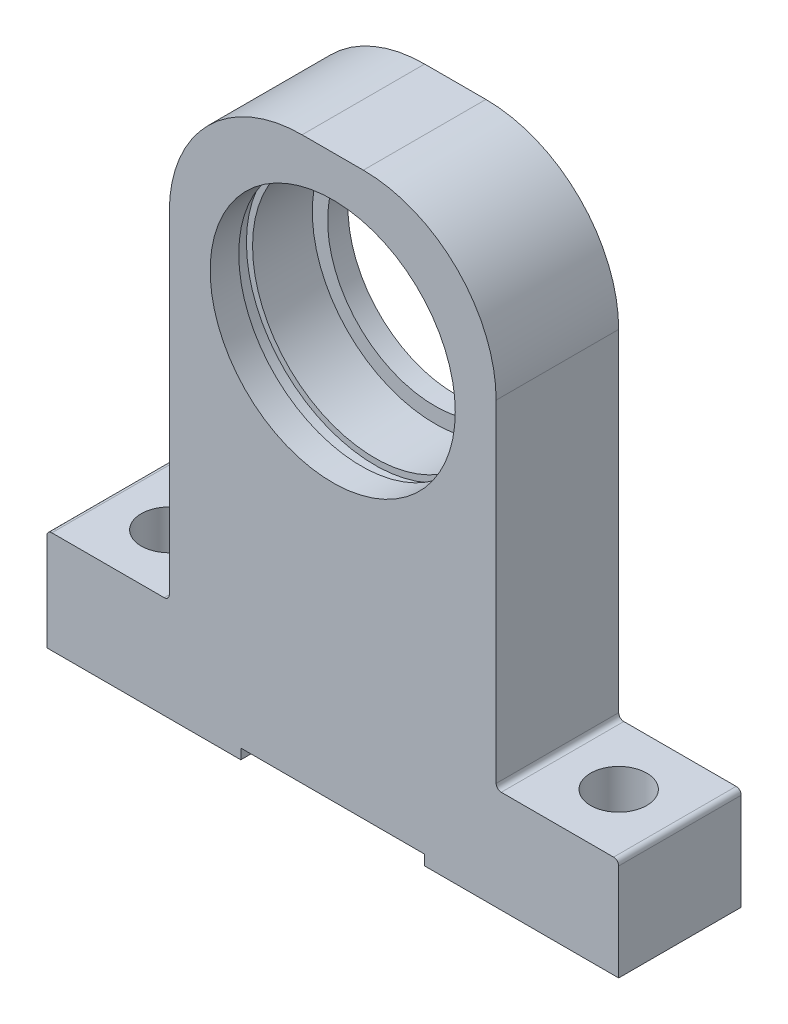
ISO-10303-21;
HEADER;
FILE_DESCRIPTION(('STEP AP214'),'2;1');
FILE_NAME('part.step','',(''),(''),'','','');
FILE_SCHEMA(('AUTOMOTIVE_DESIGN { 1 0 10303 214 1 1 1 1 }'));
ENDSEC;
DATA;
#1=APPLICATION_CONTEXT('core data for automotive mechanical design processes');
#2=APPLICATION_PROTOCOL_DEFINITION('international standard','automotive_design',2000,#1);
#3=PRODUCT_CONTEXT('',#1,'mechanical');
#4=PRODUCT('Part','Part','',(#3));
#5=PRODUCT_RELATED_PRODUCT_CATEGORY('part','',(#4));
#6=PRODUCT_DEFINITION_FORMATION('','',#4);
#7=PRODUCT_DEFINITION_CONTEXT('part definition',#1,'design');
#8=PRODUCT_DEFINITION('design','',#6,#7);
#9=PRODUCT_DEFINITION_SHAPE('','',#8);
#10=(LENGTH_UNIT() NAMED_UNIT(*) SI_UNIT(.MILLI.,.METRE.));
#11=(NAMED_UNIT(*) PLANE_ANGLE_UNIT() SI_UNIT($,.RADIAN.));
#12=(NAMED_UNIT(*) SI_UNIT($,.STERADIAN.) SOLID_ANGLE_UNIT());
#13=UNCERTAINTY_MEASURE_WITH_UNIT(LENGTH_MEASURE(1.E-05),#10,'distance_accuracy_value','');
#14=(GEOMETRIC_REPRESENTATION_CONTEXT(3) GLOBAL_UNCERTAINTY_ASSIGNED_CONTEXT((#13)) GLOBAL_UNIT_ASSIGNED_CONTEXT((#10,
#11,#12)) REPRESENTATION_CONTEXT('',''));
#15=CARTESIAN_POINT('',(0.,0.,0.));
#16=DIRECTION('',(0.,0.,1.));
#17=DIRECTION('',(1.,0.,0.));
#18=AXIS2_PLACEMENT_3D('',#15,#16,#17);
#19=CARTESIAN_POINT('',(0.,0.,2.));
#20=DIRECTION('',(0.,0.,1.));
#21=DIRECTION('',(1.,0.,0.));
#22=AXIS2_PLACEMENT_3D('',#19,#20,#21);
#23=CYLINDRICAL_SURFACE('',#22,12.);
#24=CARTESIAN_POINT('',(0.,0.,9.2));
#25=DIRECTION('',(0.,0.,-1.));
#26=DIRECTION('',(-1.,0.,0.));
#27=AXIS2_PLACEMENT_3D('',#24,#25,#26);
#28=CIRCLE('',#27,12.);
#29=CARTESIAN_POINT('',(-12.,0.,9.2));
#30=VERTEX_POINT('',#29);
#31=EDGE_CURVE('E329',#30,#30,#28,.T.);
#32=ORIENTED_EDGE('',*,*,#31,.T.);
#33=EDGE_LOOP('',(#32));
#34=FACE_BOUND('',#33,.T.);
#35=CARTESIAN_POINT('',(0.,0.,12.));
#36=DIRECTION('',(0.,0.,1.));
#37=DIRECTION('',(1.,0.,0.));
#38=AXIS2_PLACEMENT_3D('',#35,#36,#37);
#39=CIRCLE('',#38,12.);
#40=CARTESIAN_POINT('',(12.,0.,12.));
#41=VERTEX_POINT('',#40);
#42=EDGE_CURVE('E312',#41,#41,#39,.T.);
#43=ORIENTED_EDGE('',*,*,#42,.T.);
#44=EDGE_LOOP('',(#43));
#45=FACE_BOUND('',#44,.T.);
#46=ADVANCED_FACE('F34',(#34,#45),#23,.F.);
#47=CARTESIAN_POINT('',(-28.,-40.,12.));
#48=DIRECTION('',(0.,1.,0.));
#49=DIRECTION('',(-1.,0.,0.));
#50=AXIS2_PLACEMENT_3D('',#47,#48,#49);
#51=PLANE('',#50);
#52=CARTESIAN_POINT('',(-22.,-40.,6.));
#53=DIRECTION('',(0.,1.,0.));
#54=DIRECTION('',(0.,0.,1.));
#55=AXIS2_PLACEMENT_3D('',#52,#53,#54);
#56=CIRCLE('',#55,2.75);
#57=CARTESIAN_POINT('',(-22.,-40.,8.75));
#58=VERTEX_POINT('',#57);
#59=EDGE_CURVE('E299',#58,#58,#56,.T.);
#60=ORIENTED_EDGE('',*,*,#59,.T.);
#61=EDGE_LOOP('',(#60));
#62=FACE_BOUND('',#61,.T.);
#63=DIRECTION('',(1.,0.,0.));
#64=VECTOR('',#63,1.);
#65=CARTESIAN_POINT('',(-28.,-40.,0.));
#66=LINE('',#65,#64);
#67=CARTESIAN_POINT('',(-28.,-40.,0.));
#68=VERTEX_POINT('',#67);
#69=CARTESIAN_POINT('',(-9.,-40.,0.));
#70=VERTEX_POINT('',#69);
#71=EDGE_CURVE('E178',#68,#70,#66,.T.);
#72=ORIENTED_EDGE('',*,*,#71,.T.);
#73=DIRECTION('',(0.,0.,1.));
#74=VECTOR('',#73,1.);
#75=CARTESIAN_POINT('',(-9.,-40.,0.));
#76=LINE('',#75,#74);
#77=CARTESIAN_POINT('',(-9.,-40.,12.));
#78=VERTEX_POINT('',#77);
#79=EDGE_CURVE('E160',#70,#78,#76,.T.);
#80=ORIENTED_EDGE('',*,*,#79,.T.);
#81=DIRECTION('',(1.,0.,0.));
#82=VECTOR('',#81,1.);
#83=CARTESIAN_POINT('',(-28.,-40.,12.));
#84=LINE('',#83,#82);
#85=CARTESIAN_POINT('',(-28.,-40.,12.));
#86=VERTEX_POINT('',#85);
#87=EDGE_CURVE('E230',#86,#78,#84,.T.);
#88=ORIENTED_EDGE('',*,*,#87,.F.);
#89=DIRECTION('',(0.,0.,-1.));
#90=VECTOR('',#89,1.);
#91=CARTESIAN_POINT('',(-28.,-40.,12.));
#92=LINE('',#91,#90);
#93=EDGE_CURVE('E11',#86,#68,#92,.T.);
#94=ORIENTED_EDGE('',*,*,#93,.T.);
#95=EDGE_LOOP('',(#72,#80,#88,#94));
#96=FACE_BOUND('',#95,.T.);
#97=ADVANCED_FACE('F182',(#62,#96),#51,.F.);
#98=CARTESIAN_POINT('',(0.,0.,12.));
#99=DIRECTION('',(0.,0.,-1.));
#100=DIRECTION('',(-1.,0.,0.));
#101=AXIS2_PLACEMENT_3D('',#98,#99,#100);
#102=CYLINDRICAL_SURFACE('',#101,10.5);
#103=CARTESIAN_POINT('',(0.,0.,0.));
#104=DIRECTION('',(0.,0.,1.));
#105=DIRECTION('',(1.,0.,0.));
#106=AXIS2_PLACEMENT_3D('',#103,#104,#105);
#107=CIRCLE('',#106,10.5);
#108=CARTESIAN_POINT('',(10.5,0.,0.));
#109=VERTEX_POINT('',#108);
#110=EDGE_CURVE('E234',#109,#109,#107,.T.);
#111=ORIENTED_EDGE('',*,*,#110,.F.);
#112=EDGE_LOOP('',(#111));
#113=FACE_BOUND('',#112,.T.);
#114=CARTESIAN_POINT('',(0.,0.,2.));
#115=DIRECTION('',(0.,0.,1.));
#116=DIRECTION('',(1.,0.,0.));
#117=AXIS2_PLACEMENT_3D('',#114,#115,#116);
#118=CIRCLE('',#117,10.5);
#119=CARTESIAN_POINT('',(10.5,0.,2.));
#120=VERTEX_POINT('',#119);
#121=EDGE_CURVE('E38',#120,#120,#118,.T.);
#122=ORIENTED_EDGE('',*,*,#121,.T.);
#123=EDGE_LOOP('',(#122));
#124=FACE_BOUND('',#123,.T.);
#125=ADVANCED_FACE('F380',(#113,#124),#102,.F.);
#126=CARTESIAN_POINT('',(0.,0.,12.));
#127=DIRECTION('',(0.,0.,1.));
#128=DIRECTION('',(1.,0.,0.));
#129=AXIS2_PLACEMENT_3D('',#126,#127,#128);
#130=PLANE('',#129);
#131=DIRECTION('',(0.,-1.,0.));
#132=VECTOR('',#131,1.);
#133=CARTESIAN_POINT('',(-9.,-40.,12.));
#134=LINE('',#133,#132);
#135=CARTESIAN_POINT('',(-9.,-39.,12.));
#136=VERTEX_POINT('',#135);
#137=EDGE_CURVE('E166',#136,#78,#134,.T.);
#138=ORIENTED_EDGE('',*,*,#137,.F.);
#139=DIRECTION('',(-1.,0.,0.));
#140=VECTOR('',#139,1.);
#141=CARTESIAN_POINT('',(-9.,-39.,12.));
#142=LINE('',#141,#140);
#143=CARTESIAN_POINT('',(9.,-39.,12.));
#144=VERTEX_POINT('',#143);
#145=EDGE_CURVE('E180',#144,#136,#142,.T.);
#146=ORIENTED_EDGE('',*,*,#145,.F.);
#147=DIRECTION('',(0.,1.,0.));
#148=VECTOR('',#147,1.);
#149=CARTESIAN_POINT('',(9.,-40.,12.));
#150=LINE('',#149,#148);
#151=CARTESIAN_POINT('',(9.,-40.,12.));
#152=VERTEX_POINT('',#151);
#153=EDGE_CURVE('E325',#152,#144,#150,.T.);
#154=ORIENTED_EDGE('',*,*,#153,.F.);
#155=CARTESIAN_POINT('',(28.,-40.,12.));
#156=VERTEX_POINT('',#155);
#157=EDGE_CURVE('E232',#152,#156,#84,.T.);
#158=ORIENTED_EDGE('',*,*,#157,.T.);
#159=DIRECTION('',(0.,1.,0.));
#160=VECTOR('',#159,1.);
#161=CARTESIAN_POINT('',(28.,-40.,12.));
#162=LINE('',#161,#160);
#163=CARTESIAN_POINT('',(28.,-30.5,12.));
#164=VERTEX_POINT('',#163);
#165=EDGE_CURVE('E227',#156,#164,#162,.T.);
#166=ORIENTED_EDGE('',*,*,#165,.T.);
#167=CARTESIAN_POINT('',(27.5,-30.5,12.));
#168=DIRECTION('',(0.,0.,-1.));
#169=DIRECTION('',(-1.,0.,0.));
#170=AXIS2_PLACEMENT_3D('',#167,#168,#169);
#171=CIRCLE('',#170,0.500000000000007);
#172=CARTESIAN_POINT('',(27.5,-30.,12.));
#173=VERTEX_POINT('',#172);
#174=EDGE_CURVE('E58',#173,#164,#171,.T.);
#175=ORIENTED_EDGE('',*,*,#174,.F.);
#176=DIRECTION('',(-1.,0.,0.));
#177=VECTOR('',#176,1.);
#178=CARTESIAN_POINT('',(28.,-30.,12.));
#179=LINE('',#178,#177);
#180=CARTESIAN_POINT('',(16.5,-30.,12.));
#181=VERTEX_POINT('',#180);
#182=EDGE_CURVE('E225',#173,#181,#179,.T.);
#183=ORIENTED_EDGE('',*,*,#182,.T.);
#184=CARTESIAN_POINT('',(16.5,-29.5,12.));
#185=DIRECTION('',(0.,0.,-1.));
#186=DIRECTION('',(1.,0.,0.));
#187=AXIS2_PLACEMENT_3D('',#184,#185,#186);
#188=CIRCLE('',#187,0.500000000000007);
#189=CARTESIAN_POINT('',(16.,-29.5,12.));
#190=VERTEX_POINT('',#189);
#191=EDGE_CURVE('E264',#181,#190,#188,.T.);
#192=ORIENTED_EDGE('',*,*,#191,.T.);
#193=DIRECTION('',(0.,1.,0.));
#194=VECTOR('',#193,1.);
#195=CARTESIAN_POINT('',(16.,-30.,12.));
#196=LINE('',#195,#194);
#197=CARTESIAN_POINT('',(16.,3.,12.));
#198=VERTEX_POINT('',#197);
#199=EDGE_CURVE('E223',#190,#198,#196,.T.);
#200=ORIENTED_EDGE('',*,*,#199,.T.);
#201=CARTESIAN_POINT('',(3.00000000000001,3.,12.));
#202=DIRECTION('',(0.,0.,-1.));
#203=DIRECTION('',(-1.,0.,0.));
#204=AXIS2_PLACEMENT_3D('',#201,#202,#203);
#205=CIRCLE('',#204,13.);
#206=CARTESIAN_POINT('',(3.,16.,12.));
#207=VERTEX_POINT('',#206);
#208=EDGE_CURVE('E243',#207,#198,#205,.T.);
#209=ORIENTED_EDGE('',*,*,#208,.F.);
#210=DIRECTION('',(-1.,0.,0.));
#211=VECTOR('',#210,1.);
#212=CARTESIAN_POINT('',(16.,16.,12.));
#213=LINE('',#212,#211);
#214=CARTESIAN_POINT('',(-3.,16.,12.));
#215=VERTEX_POINT('',#214);
#216=EDGE_CURVE('E218',#207,#215,#213,.T.);
#217=ORIENTED_EDGE('',*,*,#216,.T.);
#218=CARTESIAN_POINT('',(-2.99999999999999,2.99999999999999,12.));
#219=DIRECTION('',(0.,0.,-1.));
#220=DIRECTION('',(-1.,0.,0.));
#221=AXIS2_PLACEMENT_3D('',#218,#219,#220);
#222=CIRCLE('',#221,13.);
#223=CARTESIAN_POINT('',(-16.,3.,12.));
#224=VERTEX_POINT('',#223);
#225=EDGE_CURVE('E254',#224,#215,#222,.T.);
#226=ORIENTED_EDGE('',*,*,#225,.F.);
#227=DIRECTION('',(0.,-1.,0.));
#228=VECTOR('',#227,1.);
#229=CARTESIAN_POINT('',(-16.,16.,12.));
#230=LINE('',#229,#228);
#231=CARTESIAN_POINT('',(-16.,-29.5,12.));
#232=VERTEX_POINT('',#231);
#233=EDGE_CURVE('E213',#224,#232,#230,.T.);
#234=ORIENTED_EDGE('',*,*,#233,.T.);
#235=CARTESIAN_POINT('',(-16.5,-29.5,12.));
#236=DIRECTION('',(0.,0.,-1.));
#237=DIRECTION('',(1.,0.,0.));
#238=AXIS2_PLACEMENT_3D('',#235,#236,#237);
#239=CIRCLE('',#238,0.500000000000002);
#240=CARTESIAN_POINT('',(-16.5,-30.,12.));
#241=VERTEX_POINT('',#240);
#242=EDGE_CURVE('E276',#232,#241,#239,.T.);
#243=ORIENTED_EDGE('',*,*,#242,.T.);
#244=DIRECTION('',(-1.,0.,0.));
#245=VECTOR('',#244,1.);
#246=CARTESIAN_POINT('',(-16.,-30.,12.));
#247=LINE('',#246,#245);
#248=CARTESIAN_POINT('',(-27.5,-30.,12.));
#249=VERTEX_POINT('',#248);
#250=EDGE_CURVE('E207',#241,#249,#247,.T.);
#251=ORIENTED_EDGE('',*,*,#250,.T.);
#252=CARTESIAN_POINT('',(-27.5,-30.5,12.));
#253=DIRECTION('',(0.,0.,-1.));
#254=DIRECTION('',(-1.,0.,0.));
#255=AXIS2_PLACEMENT_3D('',#252,#253,#254);
#256=CIRCLE('',#255,0.499999999999995);
#257=CARTESIAN_POINT('',(-28.,-30.5,12.));
#258=VERTEX_POINT('',#257);
#259=EDGE_CURVE('E286',#258,#249,#256,.T.);
#260=ORIENTED_EDGE('',*,*,#259,.F.);
#261=DIRECTION('',(0.,-1.,0.));
#262=VECTOR('',#261,1.);
#263=CARTESIAN_POINT('',(-28.,-30.,12.));
#264=LINE('',#263,#262);
#265=EDGE_CURVE('E205',#258,#86,#264,.T.);
#266=ORIENTED_EDGE('',*,*,#265,.T.);
#267=ORIENTED_EDGE('',*,*,#87,.T.);
#268=EDGE_LOOP('',(#138,#146,#154,#158,#166,#175,#183,#192,#200,#209,#217,#226,#234,#243,#251,
#260,#266,#267));
#269=FACE_BOUND('',#268,.T.);
#270=ORIENTED_EDGE('',*,*,#42,.F.);
#271=EDGE_LOOP('',(#270));
#272=FACE_BOUND('',#271,.T.);
#273=ADVANCED_FACE('F417',(#269,#272),#130,.T.);
#274=CARTESIAN_POINT('',(0.,0.,0.));
#275=DIRECTION('',(0.,0.,1.));
#276=DIRECTION('',(1.,0.,0.));
#277=AXIS2_PLACEMENT_3D('',#274,#275,#276);
#278=PLANE('',#277);
#279=ORIENTED_EDGE('',*,*,#110,.T.);
#280=EDGE_LOOP('',(#279));
#281=FACE_BOUND('',#280,.T.);
#282=DIRECTION('',(-1.,0.,0.));
#283=VECTOR('',#282,1.);
#284=CARTESIAN_POINT('',(-9.,-39.,0.));
#285=LINE('',#284,#283);
#286=CARTESIAN_POINT('',(9.,-39.,0.));
#287=VERTEX_POINT('',#286);
#288=CARTESIAN_POINT('',(-9.,-39.,0.));
#289=VERTEX_POINT('',#288);
#290=EDGE_CURVE('E172',#287,#289,#285,.T.);
#291=ORIENTED_EDGE('',*,*,#290,.T.);
#292=DIRECTION('',(0.,-1.,0.));
#293=VECTOR('',#292,1.);
#294=CARTESIAN_POINT('',(-9.,-40.,0.));
#295=LINE('',#294,#293);
#296=EDGE_CURVE('E163',#289,#70,#295,.T.);
#297=ORIENTED_EDGE('',*,*,#296,.T.);
#298=ORIENTED_EDGE('',*,*,#71,.F.);
#299=DIRECTION('',(0.,-1.,0.));
#300=VECTOR('',#299,1.);
#301=CARTESIAN_POINT('',(-28.,-30.,0.));
#302=LINE('',#301,#300);
#303=CARTESIAN_POINT('',(-28.,-30.5,0.));
#304=VERTEX_POINT('',#303);
#305=EDGE_CURVE('E190',#304,#68,#302,.T.);
#306=ORIENTED_EDGE('',*,*,#305,.F.);
#307=CARTESIAN_POINT('',(-27.5,-30.5,0.));
#308=DIRECTION('',(0.,0.,-1.));
#309=DIRECTION('',(-1.,0.,0.));
#310=AXIS2_PLACEMENT_3D('',#307,#308,#309);
#311=CIRCLE('',#310,0.499999999999995);
#312=CARTESIAN_POINT('',(-27.5,-30.,0.));
#313=VERTEX_POINT('',#312);
#314=EDGE_CURVE('E287',#304,#313,#311,.T.);
#315=ORIENTED_EDGE('',*,*,#314,.T.);
#316=DIRECTION('',(-1.,0.,0.));
#317=VECTOR('',#316,1.);
#318=CARTESIAN_POINT('',(-16.,-30.,0.));
#319=LINE('',#318,#317);
#320=CARTESIAN_POINT('',(-16.5,-30.,0.));
#321=VERTEX_POINT('',#320);
#322=EDGE_CURVE('E202',#321,#313,#319,.T.);
#323=ORIENTED_EDGE('',*,*,#322,.F.);
#324=CARTESIAN_POINT('',(-16.5,-29.5,0.));
#325=DIRECTION('',(0.,0.,-1.));
#326=DIRECTION('',(1.,0.,0.));
#327=AXIS2_PLACEMENT_3D('',#324,#325,#326);
#328=CIRCLE('',#327,0.500000000000002);
#329=CARTESIAN_POINT('',(-16.,-29.5,0.));
#330=VERTEX_POINT('',#329);
#331=EDGE_CURVE('E277',#330,#321,#328,.T.);
#332=ORIENTED_EDGE('',*,*,#331,.F.);
#333=DIRECTION('',(0.,-1.,0.));
#334=VECTOR('',#333,1.);
#335=CARTESIAN_POINT('',(-16.,16.,0.));
#336=LINE('',#335,#334);
#337=CARTESIAN_POINT('',(-16.,3.,0.));
#338=VERTEX_POINT('',#337);
#339=EDGE_CURVE('E200',#338,#330,#336,.T.);
#340=ORIENTED_EDGE('',*,*,#339,.F.);
#341=CARTESIAN_POINT('',(-2.99999999999999,2.99999999999999,0.));
#342=DIRECTION('',(0.,0.,-1.));
#343=DIRECTION('',(-1.,0.,0.));
#344=AXIS2_PLACEMENT_3D('',#341,#342,#343);
#345=CIRCLE('',#344,13.);
#346=CARTESIAN_POINT('',(-3.,16.,0.));
#347=VERTEX_POINT('',#346);
#348=EDGE_CURVE('E255',#338,#347,#345,.T.);
#349=ORIENTED_EDGE('',*,*,#348,.T.);
#350=DIRECTION('',(-1.,0.,0.));
#351=VECTOR('',#350,1.);
#352=CARTESIAN_POINT('',(16.,16.,0.));
#353=LINE('',#352,#351);
#354=CARTESIAN_POINT('',(3.,16.,0.));
#355=VERTEX_POINT('',#354);
#356=EDGE_CURVE('E197',#355,#347,#353,.T.);
#357=ORIENTED_EDGE('',*,*,#356,.F.);
#358=CARTESIAN_POINT('',(3.00000000000001,3.,0.));
#359=DIRECTION('',(0.,0.,-1.));
#360=DIRECTION('',(-1.,0.,0.));
#361=AXIS2_PLACEMENT_3D('',#358,#359,#360);
#362=CIRCLE('',#361,13.);
#363=CARTESIAN_POINT('',(16.,3.,0.));
#364=VERTEX_POINT('',#363);
#365=EDGE_CURVE('E244',#355,#364,#362,.T.);
#366=ORIENTED_EDGE('',*,*,#365,.T.);
#367=DIRECTION('',(0.,1.,0.));
#368=VECTOR('',#367,1.);
#369=CARTESIAN_POINT('',(16.,-30.,0.));
#370=LINE('',#369,#368);
#371=CARTESIAN_POINT('',(16.,-29.5,0.));
#372=VERTEX_POINT('',#371);
#373=EDGE_CURVE('E195',#372,#364,#370,.T.);
#374=ORIENTED_EDGE('',*,*,#373,.F.);
#375=CARTESIAN_POINT('',(16.5,-29.5,0.));
#376=DIRECTION('',(0.,0.,-1.));
#377=DIRECTION('',(1.,0.,0.));
#378=AXIS2_PLACEMENT_3D('',#375,#376,#377);
#379=CIRCLE('',#378,0.500000000000007);
#380=CARTESIAN_POINT('',(16.5,-30.,0.));
#381=VERTEX_POINT('',#380);
#382=EDGE_CURVE('E265',#381,#372,#379,.T.);
#383=ORIENTED_EDGE('',*,*,#382,.F.);
#384=DIRECTION('',(-1.,0.,0.));
#385=VECTOR('',#384,1.);
#386=CARTESIAN_POINT('',(28.,-30.,0.));
#387=LINE('',#386,#385);
#388=CARTESIAN_POINT('',(27.5,-30.,0.));
#389=VERTEX_POINT('',#388);
#390=EDGE_CURVE('E188',#389,#381,#387,.T.);
#391=ORIENTED_EDGE('',*,*,#390,.F.);
#392=CARTESIAN_POINT('',(27.5,-30.5,0.));
#393=DIRECTION('',(0.,0.,-1.));
#394=DIRECTION('',(-1.,0.,0.));
#395=AXIS2_PLACEMENT_3D('',#392,#393,#394);
#396=CIRCLE('',#395,0.500000000000007);
#397=CARTESIAN_POINT('',(28.,-30.5,0.));
#398=VERTEX_POINT('',#397);
#399=EDGE_CURVE('E296',#389,#398,#396,.T.);
#400=ORIENTED_EDGE('',*,*,#399,.T.);
#401=DIRECTION('',(0.,1.,0.));
#402=VECTOR('',#401,1.);
#403=CARTESIAN_POINT('',(28.,-40.,0.));
#404=LINE('',#403,#402);
#405=CARTESIAN_POINT('',(28.,-40.,0.));
#406=VERTEX_POINT('',#405);
#407=EDGE_CURVE('E184',#406,#398,#404,.T.);
#408=ORIENTED_EDGE('',*,*,#407,.F.);
#409=CARTESIAN_POINT('',(9.,-40.,0.));
#410=VERTEX_POINT('',#409);
#411=EDGE_CURVE('E185',#410,#406,#66,.T.);
#412=ORIENTED_EDGE('',*,*,#411,.F.);
#413=DIRECTION('',(0.,1.,0.));
#414=VECTOR('',#413,1.);
#415=CARTESIAN_POINT('',(9.,-40.,0.));
#416=LINE('',#415,#414);
#417=EDGE_CURVE('E50',#410,#287,#416,.T.);
#418=ORIENTED_EDGE('',*,*,#417,.T.);
#419=EDGE_LOOP('',(#291,#297,#298,#306,#315,#323,#332,#340,#349,#357,#366,#374,#383,#391,#400,
#408,#412,#418));
#420=FACE_BOUND('',#419,.T.);
#421=ADVANCED_FACE('F176',(#281,#420),#278,.F.);
#422=CARTESIAN_POINT('',(28.,-40.,12.));
#423=DIRECTION('',(-1.,0.,0.));
#424=DIRECTION('',(0.,0.,1.));
#425=AXIS2_PLACEMENT_3D('',#422,#423,#424);
#426=PLANE('',#425);
#427=DIRECTION('',(0.,0.,-1.));
#428=VECTOR('',#427,1.);
#429=CARTESIAN_POINT('',(28.,-30.5,12.));
#430=LINE('',#429,#428);
#431=EDGE_CURVE('E290',#164,#398,#430,.T.);
#432=ORIENTED_EDGE('',*,*,#431,.F.);
#433=ORIENTED_EDGE('',*,*,#165,.F.);
#434=DIRECTION('',(0.,0.,-1.));
#435=VECTOR('',#434,1.);
#436=CARTESIAN_POINT('',(28.,-40.,12.));
#437=LINE('',#436,#435);
#438=EDGE_CURVE('E43',#156,#406,#437,.T.);
#439=ORIENTED_EDGE('',*,*,#438,.T.);
#440=ORIENTED_EDGE('',*,*,#407,.T.);
#441=EDGE_LOOP('',(#432,#433,#439,#440));
#442=FACE_BOUND('',#441,.T.);
#443=ADVANCED_FACE('F423',(#442),#426,.F.);
#444=CARTESIAN_POINT('',(-16.,-30.,12.));
#445=DIRECTION('',(0.,-1.,0.));
#446=DIRECTION('',(1.,0.,0.));
#447=AXIS2_PLACEMENT_3D('',#444,#445,#446);
#448=PLANE('',#447);
#449=CARTESIAN_POINT('',(-22.,-30.,6.));
#450=DIRECTION('',(0.,1.,0.));
#451=DIRECTION('',(0.,0.,1.));
#452=AXIS2_PLACEMENT_3D('',#449,#450,#451);
#453=CIRCLE('',#452,2.75);
#454=CARTESIAN_POINT('',(-22.,-30.,8.75));
#455=VERTEX_POINT('',#454);
#456=EDGE_CURVE('E301',#455,#455,#453,.T.);
#457=ORIENTED_EDGE('',*,*,#456,.F.);
#458=EDGE_LOOP('',(#457));
#459=FACE_BOUND('',#458,.T.);
#460=DIRECTION('',(0.,0.,-1.));
#461=VECTOR('',#460,1.);
#462=CARTESIAN_POINT('',(-27.5,-30.,12.));
#463=LINE('',#462,#461);
#464=EDGE_CURVE('E280',#249,#313,#463,.T.);
#465=ORIENTED_EDGE('',*,*,#464,.F.);
#466=ORIENTED_EDGE('',*,*,#250,.F.);
#467=DIRECTION('',(0.,0.,-1.));
#468=VECTOR('',#467,1.);
#469=CARTESIAN_POINT('',(-16.5,-30.,12.));
#470=LINE('',#469,#468);
#471=EDGE_CURVE('E268',#241,#321,#470,.T.);
#472=ORIENTED_EDGE('',*,*,#471,.T.);
#473=ORIENTED_EDGE('',*,*,#322,.T.);
#474=EDGE_LOOP('',(#465,#466,#472,#473));
#475=FACE_BOUND('',#474,.T.);
#476=ADVANCED_FACE('F425',(#459,#475),#448,.F.);
#477=CARTESIAN_POINT('',(-16.,16.,12.));
#478=DIRECTION('',(1.,0.,0.));
#479=DIRECTION('',(0.,1.,0.));
#480=AXIS2_PLACEMENT_3D('',#477,#478,#479);
#481=PLANE('',#480);
#482=DIRECTION('',(0.,0.,-1.));
#483=VECTOR('',#482,1.);
#484=CARTESIAN_POINT('',(-16.,-29.5,12.));
#485=LINE('',#484,#483);
#486=EDGE_CURVE('E273',#232,#330,#485,.T.);
#487=ORIENTED_EDGE('',*,*,#486,.F.);
#488=ORIENTED_EDGE('',*,*,#233,.F.);
#489=DIRECTION('',(0.,0.,-1.));
#490=VECTOR('',#489,1.);
#491=CARTESIAN_POINT('',(-16.,3.,12.));
#492=LINE('',#491,#490);
#493=EDGE_CURVE('E251',#224,#338,#492,.T.);
#494=ORIENTED_EDGE('',*,*,#493,.T.);
#495=ORIENTED_EDGE('',*,*,#339,.T.);
#496=EDGE_LOOP('',(#487,#488,#494,#495));
#497=FACE_BOUND('',#496,.T.);
#498=ADVANCED_FACE('F428',(#497),#481,.F.);
#499=CARTESIAN_POINT('',(28.,-30.,12.));
#500=DIRECTION('',(0.,-1.,0.));
#501=DIRECTION('',(1.,0.,0.));
#502=AXIS2_PLACEMENT_3D('',#499,#500,#501);
#503=PLANE('',#502);
#504=CARTESIAN_POINT('',(22.,-30.,5.99999999999999));
#505=DIRECTION('',(0.,1.,0.));
#506=DIRECTION('',(0.,0.,1.));
#507=AXIS2_PLACEMENT_3D('',#504,#505,#506);
#508=CIRCLE('',#507,2.75);
#509=CARTESIAN_POINT('',(22.,-30.,8.74999999999999));
#510=VERTEX_POINT('',#509);
#511=EDGE_CURVE('E307',#510,#510,#508,.T.);
#512=ORIENTED_EDGE('',*,*,#511,.F.);
#513=EDGE_LOOP('',(#512));
#514=FACE_BOUND('',#513,.T.);
#515=ORIENTED_EDGE('',*,*,#182,.F.);
#516=DIRECTION('',(0.,0.,-1.));
#517=VECTOR('',#516,1.);
#518=CARTESIAN_POINT('',(27.5,-30.,12.));
#519=LINE('',#518,#517);
#520=EDGE_CURVE('E293',#173,#389,#519,.T.);
#521=ORIENTED_EDGE('',*,*,#520,.T.);
#522=ORIENTED_EDGE('',*,*,#390,.T.);
#523=DIRECTION('',(0.,0.,-1.));
#524=VECTOR('',#523,1.);
#525=CARTESIAN_POINT('',(16.5,-30.,12.));
#526=LINE('',#525,#524);
#527=EDGE_CURVE('E261',#181,#381,#526,.T.);
#528=ORIENTED_EDGE('',*,*,#527,.F.);
#529=EDGE_LOOP('',(#515,#521,#522,#528));
#530=FACE_BOUND('',#529,.T.);
#531=ADVANCED_FACE('F432',(#514,#530),#503,.F.);
#532=CARTESIAN_POINT('',(16.,16.,12.));
#533=DIRECTION('',(0.,-1.,0.));
#534=DIRECTION('',(1.,0.,0.));
#535=AXIS2_PLACEMENT_3D('',#532,#533,#534);
#536=PLANE('',#535);
#537=DIRECTION('',(0.,0.,-1.));
#538=VECTOR('',#537,1.);
#539=CARTESIAN_POINT('',(-3.,16.,12.));
#540=LINE('',#539,#538);
#541=EDGE_CURVE('E247',#215,#347,#540,.T.);
#542=ORIENTED_EDGE('',*,*,#541,.F.);
#543=ORIENTED_EDGE('',*,*,#216,.F.);
#544=DIRECTION('',(0.,0.,-1.));
#545=VECTOR('',#544,1.);
#546=CARTESIAN_POINT('',(3.,16.,12.));
#547=LINE('',#546,#545);
#548=EDGE_CURVE('E240',#207,#355,#547,.T.);
#549=ORIENTED_EDGE('',*,*,#548,.T.);
#550=ORIENTED_EDGE('',*,*,#356,.T.);
#551=EDGE_LOOP('',(#542,#543,#549,#550));
#552=FACE_BOUND('',#551,.T.);
#553=ADVANCED_FACE('F434',(#552),#536,.F.);
#554=CARTESIAN_POINT('',(16.,-30.,12.));
#555=DIRECTION('',(-1.,0.,0.));
#556=DIRECTION('',(0.,-1.,0.));
#557=AXIS2_PLACEMENT_3D('',#554,#555,#556);
#558=PLANE('',#557);
#559=ORIENTED_EDGE('',*,*,#199,.F.);
#560=DIRECTION('',(0.,0.,-1.));
#561=VECTOR('',#560,1.);
#562=CARTESIAN_POINT('',(16.,-29.5,12.));
#563=LINE('',#562,#561);
#564=EDGE_CURVE('E258',#190,#372,#563,.T.);
#565=ORIENTED_EDGE('',*,*,#564,.T.);
#566=ORIENTED_EDGE('',*,*,#373,.T.);
#567=DIRECTION('',(0.,0.,-1.));
#568=VECTOR('',#567,1.);
#569=CARTESIAN_POINT('',(16.,3.,12.));
#570=LINE('',#569,#568);
#571=EDGE_CURVE('E237',#198,#364,#570,.T.);
#572=ORIENTED_EDGE('',*,*,#571,.F.);
#573=EDGE_LOOP('',(#559,#565,#566,#572));
#574=FACE_BOUND('',#573,.T.);
#575=ADVANCED_FACE('F437',(#574),#558,.F.);
#576=CARTESIAN_POINT('',(-28.,-30.,12.));
#577=DIRECTION('',(1.,0.,0.));
#578=DIRECTION('',(0.,0.,-1.));
#579=AXIS2_PLACEMENT_3D('',#576,#577,#578);
#580=PLANE('',#579);
#581=ORIENTED_EDGE('',*,*,#265,.F.);
#582=DIRECTION('',(0.,0.,-1.));
#583=VECTOR('',#582,1.);
#584=CARTESIAN_POINT('',(-28.,-30.5,12.));
#585=LINE('',#584,#583);
#586=EDGE_CURVE('E283',#258,#304,#585,.T.);
#587=ORIENTED_EDGE('',*,*,#586,.T.);
#588=ORIENTED_EDGE('',*,*,#305,.T.);
#589=ORIENTED_EDGE('',*,*,#93,.F.);
#590=EDGE_LOOP('',(#581,#587,#588,#589));
#591=FACE_BOUND('',#590,.T.);
#592=ADVANCED_FACE('F36',(#591),#580,.F.);
#593=CARTESIAN_POINT('',(22.,-40.,5.99999999999999));
#594=DIRECTION('',(0.,1.,0.));
#595=DIRECTION('',(0.,0.,1.));
#596=AXIS2_PLACEMENT_3D('',#593,#594,#595);
#597=CIRCLE('',#596,2.75);
#598=CARTESIAN_POINT('',(22.,-40.,8.74999999999999));
#599=VERTEX_POINT('',#598);
#600=EDGE_CURVE('E304',#599,#599,#597,.T.);
#601=ORIENTED_EDGE('',*,*,#600,.T.);
#602=EDGE_LOOP('',(#601));
#603=FACE_BOUND('',#602,.T.);
#604=ORIENTED_EDGE('',*,*,#157,.F.);
#605=DIRECTION('',(0.,0.,1.));
#606=VECTOR('',#605,1.);
#607=CARTESIAN_POINT('',(9.,-40.,0.));
#608=LINE('',#607,#606);
#609=EDGE_CURVE('E171',#410,#152,#608,.T.);
#610=ORIENTED_EDGE('',*,*,#609,.F.);
#611=ORIENTED_EDGE('',*,*,#411,.T.);
#612=ORIENTED_EDGE('',*,*,#438,.F.);
#613=EDGE_LOOP('',(#604,#610,#611,#612));
#614=FACE_BOUND('',#613,.T.);
#615=ADVANCED_FACE('F382',(#603,#614),#51,.F.);
#616=CARTESIAN_POINT('',(3.00000000000001,3.,12.));
#617=DIRECTION('',(0.,0.,-1.));
#618=DIRECTION('',(-1.,0.,0.));
#619=AXIS2_PLACEMENT_3D('',#616,#617,#618);
#620=CYLINDRICAL_SURFACE('',#619,13.);
#621=ORIENTED_EDGE('',*,*,#365,.F.);
#622=ORIENTED_EDGE('',*,*,#548,.F.);
#623=ORIENTED_EDGE('',*,*,#208,.T.);
#624=ORIENTED_EDGE('',*,*,#571,.T.);
#625=EDGE_LOOP('',(#621,#622,#623,#624));
#626=FACE_BOUND('',#625,.T.);
#627=ADVANCED_FACE('F410',(#626),#620,.T.);
#628=CARTESIAN_POINT('',(-2.99999999999999,2.99999999999999,12.));
#629=DIRECTION('',(0.,0.,-1.));
#630=DIRECTION('',(-1.,0.,0.));
#631=AXIS2_PLACEMENT_3D('',#628,#629,#630);
#632=CYLINDRICAL_SURFACE('',#631,13.);
#633=ORIENTED_EDGE('',*,*,#348,.F.);
#634=ORIENTED_EDGE('',*,*,#493,.F.);
#635=ORIENTED_EDGE('',*,*,#225,.T.);
#636=ORIENTED_EDGE('',*,*,#541,.T.);
#637=EDGE_LOOP('',(#633,#634,#635,#636));
#638=FACE_BOUND('',#637,.T.);
#639=ADVANCED_FACE('F406',(#638),#632,.T.);
#640=CARTESIAN_POINT('',(16.5,-29.5,12.));
#641=DIRECTION('',(0.,0.,-1.));
#642=DIRECTION('',(-1.,0.,0.));
#643=AXIS2_PLACEMENT_3D('',#640,#641,#642);
#644=CYLINDRICAL_SURFACE('',#643,0.500000000000007);
#645=ORIENTED_EDGE('',*,*,#382,.T.);
#646=ORIENTED_EDGE('',*,*,#564,.F.);
#647=ORIENTED_EDGE('',*,*,#191,.F.);
#648=ORIENTED_EDGE('',*,*,#527,.T.);
#649=EDGE_LOOP('',(#645,#646,#647,#648));
#650=FACE_BOUND('',#649,.T.);
#651=ADVANCED_FACE('F402',(#650),#644,.F.);
#652=CARTESIAN_POINT('',(-16.5,-29.5,12.));
#653=DIRECTION('',(0.,0.,-1.));
#654=DIRECTION('',(-1.,0.,0.));
#655=AXIS2_PLACEMENT_3D('',#652,#653,#654);
#656=CYLINDRICAL_SURFACE('',#655,0.500000000000002);
#657=ORIENTED_EDGE('',*,*,#331,.T.);
#658=ORIENTED_EDGE('',*,*,#471,.F.);
#659=ORIENTED_EDGE('',*,*,#242,.F.);
#660=ORIENTED_EDGE('',*,*,#486,.T.);
#661=EDGE_LOOP('',(#657,#658,#659,#660));
#662=FACE_BOUND('',#661,.T.);
#663=ADVANCED_FACE('F398',(#662),#656,.F.);
#664=CARTESIAN_POINT('',(-27.5,-30.5,12.));
#665=DIRECTION('',(0.,0.,-1.));
#666=DIRECTION('',(-1.,0.,0.));
#667=AXIS2_PLACEMENT_3D('',#664,#665,#666);
#668=CYLINDRICAL_SURFACE('',#667,0.499999999999995);
#669=ORIENTED_EDGE('',*,*,#314,.F.);
#670=ORIENTED_EDGE('',*,*,#586,.F.);
#671=ORIENTED_EDGE('',*,*,#259,.T.);
#672=ORIENTED_EDGE('',*,*,#464,.T.);
#673=EDGE_LOOP('',(#669,#670,#671,#672));
#674=FACE_BOUND('',#673,.T.);
#675=ADVANCED_FACE('F395',(#674),#668,.T.);
#676=CARTESIAN_POINT('',(27.5,-30.5,12.));
#677=DIRECTION('',(0.,0.,-1.));
#678=DIRECTION('',(-1.,0.,0.));
#679=AXIS2_PLACEMENT_3D('',#676,#677,#678);
#680=CYLINDRICAL_SURFACE('',#679,0.500000000000007);
#681=ORIENTED_EDGE('',*,*,#399,.F.);
#682=ORIENTED_EDGE('',*,*,#520,.F.);
#683=ORIENTED_EDGE('',*,*,#174,.T.);
#684=ORIENTED_EDGE('',*,*,#431,.T.);
#685=EDGE_LOOP('',(#681,#682,#683,#684));
#686=FACE_BOUND('',#685,.T.);
#687=ADVANCED_FACE('F391',(#686),#680,.T.);
#688=CARTESIAN_POINT('',(-22.,-40.,6.));
#689=DIRECTION('',(0.,1.,0.));
#690=DIRECTION('',(0.,0.,1.));
#691=AXIS2_PLACEMENT_3D('',#688,#689,#690);
#692=CYLINDRICAL_SURFACE('',#691,2.75);
#693=ORIENTED_EDGE('',*,*,#59,.F.);
#694=EDGE_LOOP('',(#693));
#695=FACE_BOUND('',#694,.T.);
#696=ORIENTED_EDGE('',*,*,#456,.T.);
#697=EDGE_LOOP('',(#696));
#698=FACE_BOUND('',#697,.T.);
#699=ADVANCED_FACE('F387',(#695,#698),#692,.F.);
#700=CARTESIAN_POINT('',(22.,-40.,5.99999999999999));
#701=DIRECTION('',(0.,1.,0.));
#702=DIRECTION('',(0.,0.,1.));
#703=AXIS2_PLACEMENT_3D('',#700,#701,#702);
#704=CYLINDRICAL_SURFACE('',#703,2.75);
#705=ORIENTED_EDGE('',*,*,#600,.F.);
#706=EDGE_LOOP('',(#705));
#707=FACE_BOUND('',#706,.T.);
#708=ORIENTED_EDGE('',*,*,#511,.T.);
#709=EDGE_LOOP('',(#708));
#710=FACE_BOUND('',#709,.T.);
#711=ADVANCED_FACE('F362',(#707,#710),#704,.F.);
#712=CARTESIAN_POINT('',(0.,0.,7.85));
#713=DIRECTION('',(0.,0.,-1.));
#714=DIRECTION('',(-1.,0.,0.));
#715=AXIS2_PLACEMENT_3D('',#712,#713,#714);
#716=CIRCLE('',#715,12.);
#717=CARTESIAN_POINT('',(-12.,0.,7.85));
#718=VERTEX_POINT('',#717);
#719=EDGE_CURVE('E334',#718,#718,#716,.T.);
#720=ORIENTED_EDGE('',*,*,#719,.F.);
#721=EDGE_LOOP('',(#720));
#722=FACE_BOUND('',#721,.T.);
#723=CARTESIAN_POINT('',(0.,0.,2.));
#724=DIRECTION('',(0.,0.,1.));
#725=DIRECTION('',(1.,0.,0.));
#726=AXIS2_PLACEMENT_3D('',#723,#724,#725);
#727=CIRCLE('',#726,12.);
#728=CARTESIAN_POINT('',(12.,0.,2.));
#729=VERTEX_POINT('',#728);
#730=EDGE_CURVE('E315',#729,#729,#727,.T.);
#731=ORIENTED_EDGE('',*,*,#730,.F.);
#732=EDGE_LOOP('',(#731));
#733=FACE_BOUND('',#732,.T.);
#734=ADVANCED_FACE('F358',(#722,#733),#23,.F.);
#735=CARTESIAN_POINT('',(0.,0.,2.));
#736=DIRECTION('',(0.,0.,1.));
#737=DIRECTION('',(1.,0.,0.));
#738=AXIS2_PLACEMENT_3D('',#735,#736,#737);
#739=PLANE('',#738);
#740=ORIENTED_EDGE('',*,*,#121,.F.);
#741=EDGE_LOOP('',(#740));
#742=FACE_BOUND('',#741,.T.);
#743=ORIENTED_EDGE('',*,*,#730,.T.);
#744=EDGE_LOOP('',(#743));
#745=FACE_BOUND('',#744,.T.);
#746=ADVANCED_FACE('F361',(#742,#745),#739,.T.);
#747=CARTESIAN_POINT('',(-9.,-40.,0.));
#748=DIRECTION('',(-1.,0.,0.));
#749=DIRECTION('',(0.,0.,1.));
#750=AXIS2_PLACEMENT_3D('',#747,#748,#749);
#751=PLANE('',#750);
#752=ORIENTED_EDGE('',*,*,#137,.T.);
#753=ORIENTED_EDGE('',*,*,#79,.F.);
#754=ORIENTED_EDGE('',*,*,#296,.F.);
#755=DIRECTION('',(0.,0.,1.));
#756=VECTOR('',#755,1.);
#757=CARTESIAN_POINT('',(-9.,-39.,0.));
#758=LINE('',#757,#756);
#759=EDGE_CURVE('E316',#289,#136,#758,.T.);
#760=ORIENTED_EDGE('',*,*,#759,.T.);
#761=EDGE_LOOP('',(#752,#753,#754,#760));
#762=FACE_BOUND('',#761,.T.);
#763=ADVANCED_FACE('F162',(#762),#751,.F.);
#764=CARTESIAN_POINT('',(-9.,-39.,0.));
#765=DIRECTION('',(0.,1.,0.));
#766=DIRECTION('',(0.,0.,1.));
#767=AXIS2_PLACEMENT_3D('',#764,#765,#766);
#768=PLANE('',#767);
#769=ORIENTED_EDGE('',*,*,#145,.T.);
#770=ORIENTED_EDGE('',*,*,#759,.F.);
#771=ORIENTED_EDGE('',*,*,#290,.F.);
#772=DIRECTION('',(0.,0.,1.));
#773=VECTOR('',#772,1.);
#774=CARTESIAN_POINT('',(9.,-39.,0.));
#775=LINE('',#774,#773);
#776=EDGE_CURVE('E320',#287,#144,#775,.T.);
#777=ORIENTED_EDGE('',*,*,#776,.T.);
#778=EDGE_LOOP('',(#769,#770,#771,#777));
#779=FACE_BOUND('',#778,.T.);
#780=ADVANCED_FACE('F372',(#779),#768,.F.);
#781=CARTESIAN_POINT('',(9.,-40.,0.));
#782=DIRECTION('',(1.,0.,0.));
#783=DIRECTION('',(0.,0.,-1.));
#784=AXIS2_PLACEMENT_3D('',#781,#782,#783);
#785=PLANE('',#784);
#786=ORIENTED_EDGE('',*,*,#153,.T.);
#787=ORIENTED_EDGE('',*,*,#776,.F.);
#788=ORIENTED_EDGE('',*,*,#417,.F.);
#789=ORIENTED_EDGE('',*,*,#609,.T.);
#790=EDGE_LOOP('',(#786,#787,#788,#789));
#791=FACE_BOUND('',#790,.T.);
#792=ADVANCED_FACE('F459',(#791),#785,.F.);
#793=CARTESIAN_POINT('',(0.,12.6,9.2));
#794=DIRECTION('',(0.,0.,1.));
#795=DIRECTION('',(1.,0.,0.));
#796=AXIS2_PLACEMENT_3D('',#793,#794,#795);
#797=PLANE('',#796);
#798=ORIENTED_EDGE('',*,*,#31,.F.);
#799=EDGE_LOOP('',(#798));
#800=FACE_BOUND('',#799,.T.);
#801=CARTESIAN_POINT('',(0.,0.,9.2));
#802=DIRECTION('',(0.,0.,-1.));
#803=DIRECTION('',(-1.,0.,0.));
#804=AXIS2_PLACEMENT_3D('',#801,#802,#803);
#805=CIRCLE('',#804,12.6);
#806=CARTESIAN_POINT('',(-12.6,0.,9.2));
#807=VERTEX_POINT('',#806);
#808=EDGE_CURVE('E340',#807,#807,#805,.T.);
#809=ORIENTED_EDGE('',*,*,#808,.T.);
#810=EDGE_LOOP('',(#809));
#811=FACE_BOUND('',#810,.T.);
#812=ADVANCED_FACE('F344',(#800,#811),#797,.F.);
#813=CARTESIAN_POINT('',(0.,12.6,7.85));
#814=DIRECTION('',(0.,0.,-1.));
#815=DIRECTION('',(-1.,0.,0.));
#816=AXIS2_PLACEMENT_3D('',#813,#814,#815);
#817=PLANE('',#816);
#818=CARTESIAN_POINT('',(0.,0.,7.85));
#819=DIRECTION('',(0.,0.,-1.));
#820=DIRECTION('',(-1.,0.,0.));
#821=AXIS2_PLACEMENT_3D('',#818,#819,#820);
#822=CIRCLE('',#821,12.6);
#823=CARTESIAN_POINT('',(-12.6,0.,7.85));
#824=VERTEX_POINT('',#823);
#825=EDGE_CURVE('E337',#824,#824,#822,.T.);
#826=ORIENTED_EDGE('',*,*,#825,.F.);
#827=EDGE_LOOP('',(#826));
#828=FACE_BOUND('',#827,.T.);
#829=ORIENTED_EDGE('',*,*,#719,.T.);
#830=EDGE_LOOP('',(#829));
#831=FACE_BOUND('',#830,.T.);
#832=ADVANCED_FACE('F349',(#828,#831),#817,.F.);
#833=CARTESIAN_POINT('',(0.,0.,-88.99));
#834=DIRECTION('',(0.,0.,-1.));
#835=DIRECTION('',(-1.,0.,0.));
#836=AXIS2_PLACEMENT_3D('',#833,#834,#835);
#837=CYLINDRICAL_SURFACE('',#836,12.6);
#838=ORIENTED_EDGE('',*,*,#808,.F.);
#839=EDGE_LOOP('',(#838));
#840=FACE_BOUND('',#839,.T.);
#841=ORIENTED_EDGE('',*,*,#825,.T.);
#842=EDGE_LOOP('',(#841));
#843=FACE_BOUND('',#842,.T.);
#844=ADVANCED_FACE('F346',(#840,#843),#837,.F.);
#845=CLOSED_SHELL('',(#46,#97,#125,#273,#421,#443,#476,#498,#531,#553,#575,#592,#615,#627,#639,
#651,#663,#675,#687,#699,#711,#734,#746,#763,#780,#792,#812,#832,#844));
#846=MANIFOLD_SOLID_BREP('B2',#845);
#847=ADVANCED_BREP_SHAPE_REPRESENTATION('',(#18,#846),#14);
#848=SHAPE_DEFINITION_REPRESENTATION(#9,#847);
ENDSEC;
END-ISO-10303-21;
